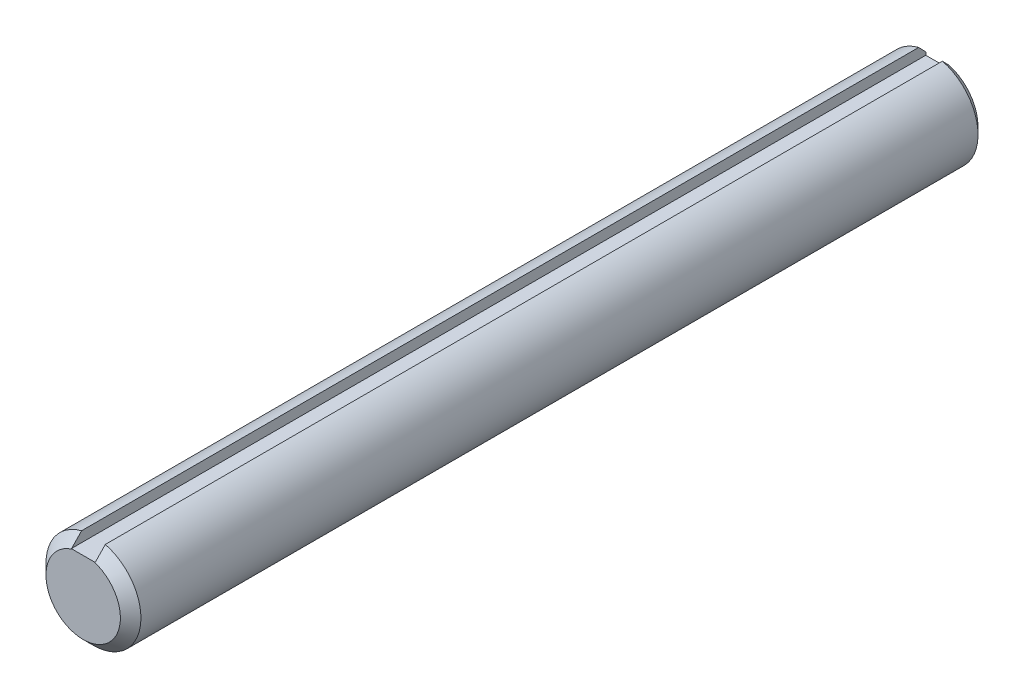
ISO-10303-21;
HEADER;
FILE_DESCRIPTION(('STEP AP214'),'2;1');
FILE_NAME('part.step','',(''),(''),'','','');
FILE_SCHEMA(('AUTOMOTIVE_DESIGN { 1 0 10303 214 1 1 1 1 }'));
ENDSEC;
DATA;
#1=APPLICATION_CONTEXT('core data for automotive mechanical design processes');
#2=APPLICATION_PROTOCOL_DEFINITION('international standard','automotive_design',2000,#1);
#3=PRODUCT_CONTEXT('',#1,'mechanical');
#4=PRODUCT('Part','Part','',(#3));
#5=PRODUCT_RELATED_PRODUCT_CATEGORY('part','',(#4));
#6=PRODUCT_DEFINITION_FORMATION('','',#4);
#7=PRODUCT_DEFINITION_CONTEXT('part definition',#1,'design');
#8=PRODUCT_DEFINITION('design','',#6,#7);
#9=PRODUCT_DEFINITION_SHAPE('','',#8);
#10=(LENGTH_UNIT() NAMED_UNIT(*) SI_UNIT(.MILLI.,.METRE.));
#11=(NAMED_UNIT(*) PLANE_ANGLE_UNIT() SI_UNIT($,.RADIAN.));
#12=(NAMED_UNIT(*) SI_UNIT($,.STERADIAN.) SOLID_ANGLE_UNIT());
#13=UNCERTAINTY_MEASURE_WITH_UNIT(LENGTH_MEASURE(1.E-05),#10,'distance_accuracy_value','');
#14=(GEOMETRIC_REPRESENTATION_CONTEXT(3) GLOBAL_UNCERTAINTY_ASSIGNED_CONTEXT((#13)) GLOBAL_UNIT_ASSIGNED_CONTEXT((#10,
#11,#12)) REPRESENTATION_CONTEXT('',''));
#15=CARTESIAN_POINT('',(0.,0.,0.));
#16=DIRECTION('',(0.,0.,1.));
#17=DIRECTION('',(1.,0.,0.));
#18=AXIS2_PLACEMENT_3D('',#15,#16,#17);
#19=CARTESIAN_POINT('',(0.,0.,76.2));
#20=DIRECTION('',(0.,0.,-1.));
#21=DIRECTION('',(-1.,0.,0.));
#22=AXIS2_PLACEMENT_3D('',#19,#20,#21);
#23=CYLINDRICAL_SURFACE('',#22,6.35);
#24=DIRECTION('',(0.,0.,-1.));
#25=VECTOR('',#24,1.);
#26=CARTESIAN_POINT('',(1.5875,6.14836106210427,76.2));
#27=LINE('',#26,#25);
#28=CARTESIAN_POINT('',(1.5875,6.14836106210427,-75.2474999999999));
#29=VERTEX_POINT('',#28);
#30=CARTESIAN_POINT('',(1.5875,6.14836106210427,36.726477474));
#31=VERTEX_POINT('',#30);
#32=EDGE_CURVE('E121',#29,#31,#27,.F.);
#33=ORIENTED_EDGE('',*,*,#32,.T.);
#34=CARTESIAN_POINT('',(0.,0.,36.726477474));
#35=DIRECTION('',(0.,0.,1.));
#36=DIRECTION('',(1.,0.,0.));
#37=AXIS2_PLACEMENT_3D('',#34,#35,#36);
#38=CIRCLE('',#37,6.35);
#39=CARTESIAN_POINT('',(-1.5875,6.14836106210427,36.726477474));
#40=VERTEX_POINT('',#39);
#41=EDGE_CURVE('E50',#31,#40,#38,.F.);
#42=ORIENTED_EDGE('',*,*,#41,.T.);
#43=DIRECTION('',(0.,0.,-1.));
#44=VECTOR('',#43,1.);
#45=CARTESIAN_POINT('',(-1.5875,6.14836106210427,76.2));
#46=LINE('',#45,#44);
#47=CARTESIAN_POINT('',(-1.5875,6.14836106210427,-75.2474999999999));
#48=VERTEX_POINT('',#47);
#49=EDGE_CURVE('E131',#40,#48,#46,.T.);
#50=ORIENTED_EDGE('',*,*,#49,.T.);
#51=CARTESIAN_POINT('',(0.,0.,-75.2474999999999));
#52=DIRECTION('',(0.,0.,1.));
#53=DIRECTION('',(1.,0.,0.));
#54=AXIS2_PLACEMENT_3D('',#51,#52,#53);
#55=CIRCLE('',#54,6.35);
#56=EDGE_CURVE('E169',#48,#29,#55,.T.);
#57=ORIENTED_EDGE('',*,*,#56,.T.);
#58=EDGE_LOOP('',(#33,#42,#50,#57));
#59=FACE_BOUND('',#58,.T.);
#60=ADVANCED_FACE('F35',(#59),#23,.T.);
#61=CARTESIAN_POINT('',(-1.5875,6.35,-76.2));
#62=DIRECTION('',(-1.,0.,0.));
#63=DIRECTION('',(0.,-1.,0.));
#64=AXIS2_PLACEMENT_3D('',#61,#62,#63);
#65=PLANE('',#64);
#66=ORIENTED_EDGE('',*,*,#49,.F.);
#67=CARTESIAN_POINT('',(-1.5875,6.14836106210428,36.726477474));
#68=CARTESIAN_POINT('',(-1.5875,6.03336789474387,36.837816321873));
#69=CARTESIAN_POINT('',(-1.5875,5.91827987354909,36.9490573642583));
#70=CARTESIAN_POINT('',(-1.5875,5.68787357366818,37.1712992426098));
#71=CARTESIAN_POINT('',(-1.5875,5.57255529644475,37.2823000800926));
#72=CARTESIAN_POINT('',(-1.5875,5.34164624267527,37.5040185916594));
#73=CARTESIAN_POINT('',(-1.5875,5.22605546557106,37.6147362651625));
#74=CARTESIAN_POINT('',(-1.5875,4.99454160696051,37.8358250479106));
#75=CARTESIAN_POINT('',(-1.5875,4.87861852334753,37.9461961549492));
#76=CARTESIAN_POINT('',(-1.5875,4.7625,38.0563616884828));
#77=B_SPLINE_CURVE_WITH_KNOTS('',3,(#67,#68,#69,#70,#71,#72,#73,#74,#75,#76),.UNSPECIFIED.,.F.,
.F.,(4,2,2,2,4),(0.,0.480185385737945,0.960367730767003,1.44055106023391,1.9207374405834),.UNSPECIFIED.);
#78=CARTESIAN_POINT('',(-1.5875,4.7625,38.0563616884827));
#79=VERTEX_POINT('',#78);
#80=EDGE_CURVE('E12',#40,#79,#77,.T.);
#81=ORIENTED_EDGE('',*,*,#80,.T.);
#82=DIRECTION('',(0.,0.,1.));
#83=VECTOR('',#82,1.);
#84=CARTESIAN_POINT('',(-1.5875,4.7625,-76.2));
#85=LINE('',#84,#83);
#86=CARTESIAN_POINT('',(-1.5875,4.7625,-76.2));
#87=VERTEX_POINT('',#86);
#88=EDGE_CURVE('E93',#87,#79,#85,.T.);
#89=ORIENTED_EDGE('',*,*,#88,.F.);
#90=DIRECTION('',(0.,-1.,0.));
#91=VECTOR('',#90,1.);
#92=CARTESIAN_POINT('',(-1.5875,6.35,-76.2));
#93=LINE('',#92,#91);
#94=CARTESIAN_POINT('',(-1.5875,5.15876438694372,-76.2));
#95=VERTEX_POINT('',#94);
#96=EDGE_CURVE('E98',#95,#87,#93,.T.);
#97=ORIENTED_EDGE('',*,*,#96,.F.);
#98=CARTESIAN_POINT('',(-1.5875,2.50467512422004,-78.6321073231548));
#99=CARTESIAN_POINT('',(-1.5875,2.6199574879908,-78.5346705663947));
#100=CARTESIAN_POINT('',(-1.5875,2.73434819416604,-78.4361940960173));
#101=CARTESIAN_POINT('',(-1.5875,2.96171067704997,-78.2376318023627));
#102=CARTESIAN_POINT('',(-1.5875,3.07468256144112,-78.1375461025497));
#103=CARTESIAN_POINT('',(-1.5875,3.29956921576393,-77.9362383617078));
#104=CARTESIAN_POINT('',(-1.5875,3.41148417069844,-77.8350165265981));
#105=CARTESIAN_POINT('',(-1.5875,3.63450717009294,-77.6316835974312));
#106=CARTESIAN_POINT('',(-1.5875,3.74561519672356,-77.5295724838341));
#107=CARTESIAN_POINT('',(-1.5875,4.0779404146334,-77.2222751639229));
#108=CARTESIAN_POINT('',(-1.5875,4.29821694512226,-77.0160724676453));
#109=CARTESIAN_POINT('',(-1.5875,4.73715914530377,-76.6019423042723));
#110=CARTESIAN_POINT('',(-1.5875,4.95582472940174,-76.3940147467598));
#111=CARTESIAN_POINT('',(-1.5875,5.3919758515553,-75.9770487299095));
#112=CARTESIAN_POINT('',(-1.5875,5.60946170363256,-75.7680105987989));
#113=CARTESIAN_POINT('',(-1.5875,6.04362892921901,-75.3491110156674));
#114=CARTESIAN_POINT('',(-1.5875,6.26031032050704,-75.1392495820551));
#115=CARTESIAN_POINT('',(-1.5875,6.69313054205313,-74.7188746527964));
#116=CARTESIAN_POINT('',(-1.5875,6.90926924461324,-74.5083610257473));
#117=CARTESIAN_POINT('',(-1.5875,7.34108970538697,-74.0868665375563));
#118=CARTESIAN_POINT('',(-1.5875,7.55677146466178,-73.8758856775018));
#119=CARTESIAN_POINT('',(-1.5875,7.77229162734195,-73.6647404933434));
#120=B_SPLINE_CURVE_WITH_KNOTS('',3,(#98,#99,#100,#101,#102,#103,#104,#105,#106,#107,#108,#109,
#110,#111,#112,#113,#114,#115,#116,#117,#118,#119),.UNSPECIFIED.,.F.,.F.,(4,2,2,2,2,2,2,2,2,2,
4),(0.,0.452810247519127,0.905585918444131,1.35828081011678,1.81098567399958,2.71616025534631,
3.6213825895487,4.52635081760593,5.43129892508637,6.33644306352773,7.24158509760043),.UNSPECIFIED.);
#121=EDGE_CURVE('E171',#95,#48,#120,.T.);
#122=ORIENTED_EDGE('',*,*,#121,.T.);
#123=EDGE_LOOP('',(#66,#81,#89,#97,#122));
#124=FACE_BOUND('',#123,.T.);
#125=ADVANCED_FACE('F95',(#124),#65,.F.);
#126=CARTESIAN_POINT('',(1.5875,6.35,-76.2));
#127=DIRECTION('',(1.,0.,0.));
#128=DIRECTION('',(0.,1.,0.));
#129=AXIS2_PLACEMENT_3D('',#126,#127,#128);
#130=PLANE('',#129);
#131=DIRECTION('',(0.,0.,1.));
#132=VECTOR('',#131,1.);
#133=CARTESIAN_POINT('',(1.5875,4.7625,-76.2));
#134=LINE('',#133,#132);
#135=CARTESIAN_POINT('',(1.5875,4.7625,-76.2));
#136=VERTEX_POINT('',#135);
#137=CARTESIAN_POINT('',(1.5875,4.7625,38.0563616884827));
#138=VERTEX_POINT('',#137);
#139=EDGE_CURVE('E103',#136,#138,#134,.T.);
#140=ORIENTED_EDGE('',*,*,#139,.T.);
#141=CARTESIAN_POINT('',(1.5875,4.7625,38.0563616884828));
#142=CARTESIAN_POINT('',(1.5875,4.87861852334753,37.9461961549492));
#143=CARTESIAN_POINT('',(1.5875,4.99454160696051,37.8358250479106));
#144=CARTESIAN_POINT('',(1.5875,5.22605546557106,37.6147362651625));
#145=CARTESIAN_POINT('',(1.5875,5.34164624267527,37.5040185916594));
#146=CARTESIAN_POINT('',(1.5875,5.57255529644475,37.2823000800926));
#147=CARTESIAN_POINT('',(1.5875,5.68787357366818,37.1712992426098));
#148=CARTESIAN_POINT('',(1.5875,5.91827987354909,36.9490573642583));
#149=CARTESIAN_POINT('',(1.5875,6.03336789474387,36.837816321873));
#150=CARTESIAN_POINT('',(1.5875,6.14836106210428,36.726477474));
#151=B_SPLINE_CURVE_WITH_KNOTS('',3,(#141,#142,#143,#144,#145,#146,#147,#148,#149,#150),
.UNSPECIFIED.,.F.,.F.,(4,2,2,2,4),(0.,0.480186380349486,0.960369709816393,1.44055205484545,
1.9207374405834),.UNSPECIFIED.);
#152=EDGE_CURVE('E64',#138,#31,#151,.T.);
#153=ORIENTED_EDGE('',*,*,#152,.T.);
#154=ORIENTED_EDGE('',*,*,#32,.F.);
#155=CARTESIAN_POINT('',(1.5875,7.77229162734195,-73.6647404933434));
#156=CARTESIAN_POINT('',(1.5875,7.55677146466178,-73.8758856775018));
#157=CARTESIAN_POINT('',(1.5875,7.34108970538697,-74.0868665375563));
#158=CARTESIAN_POINT('',(1.5875,6.90926924461324,-74.5083610257473));
#159=CARTESIAN_POINT('',(1.5875,6.69313054205313,-74.7188746527964));
#160=CARTESIAN_POINT('',(1.5875,6.26031032050704,-75.1392495820551));
#161=CARTESIAN_POINT('',(1.5875,6.04362892921901,-75.3491110156674));
#162=CARTESIAN_POINT('',(1.5875,5.60946170363256,-75.7680105987989));
#163=CARTESIAN_POINT('',(1.5875,5.3919758515553,-75.9770487299095));
#164=CARTESIAN_POINT('',(1.5875,4.95582472940174,-76.3940147467598));
#165=CARTESIAN_POINT('',(1.5875,4.73715914530377,-76.6019423042723));
#166=CARTESIAN_POINT('',(1.5875,4.29821694512226,-77.0160724676453));
#167=CARTESIAN_POINT('',(1.5875,4.0779404146334,-77.2222751639229));
#168=CARTESIAN_POINT('',(1.5875,3.74561519672356,-77.5295724838341));
#169=CARTESIAN_POINT('',(1.5875,3.63450717009294,-77.6316835974312));
#170=CARTESIAN_POINT('',(1.5875,3.41148417069844,-77.8350165265981));
#171=CARTESIAN_POINT('',(1.5875,3.29956921576393,-77.9362383617078));
#172=CARTESIAN_POINT('',(1.5875,3.07468256144112,-78.1375461025497));
#173=CARTESIAN_POINT('',(1.5875,2.96171067704997,-78.2376318023627));
#174=CARTESIAN_POINT('',(1.5875,2.73434819416604,-78.4361940960173));
#175=CARTESIAN_POINT('',(1.5875,2.6199574879908,-78.5346705663947));
#176=CARTESIAN_POINT('',(1.5875,2.50467512422004,-78.6321073231548));
#177=B_SPLINE_CURVE_WITH_KNOTS('',3,(#155,#156,#157,#158,#159,#160,#161,#162,#163,#164,#165,
#166,#167,#168,#169,#170,#171,#172,#173,#174,#175,#176),.UNSPECIFIED.,.F.,.F.,(4,2,2,2,2,2,2,2,
2,2,4),(0.,0.905142034072703,1.81028617251406,2.7152342799945,3.62020250805173,4.52542484225412,
5.43059942360086,5.88330428748366,6.3359991791563,6.7887748500813,7.24158509760043),.UNSPECIFIED.);
#178=CARTESIAN_POINT('',(1.5875,5.15876438694372,-76.2));
#179=VERTEX_POINT('',#178);
#180=EDGE_CURVE('E124',#29,#179,#177,.T.);
#181=ORIENTED_EDGE('',*,*,#180,.T.);
#182=DIRECTION('',(0.,1.,0.));
#183=VECTOR('',#182,1.);
#184=CARTESIAN_POINT('',(1.5875,6.35,-76.2));
#185=LINE('',#184,#183);
#186=EDGE_CURVE('E104',#136,#179,#185,.T.);
#187=ORIENTED_EDGE('',*,*,#186,.F.);
#188=EDGE_LOOP('',(#140,#153,#154,#181,#187));
#189=FACE_BOUND('',#188,.T.);
#190=ADVANCED_FACE('F136',(#189),#130,.F.);
#191=CARTESIAN_POINT('',(-1.5875,4.7625,-76.2));
#192=DIRECTION('',(0.,-1.,0.));
#193=DIRECTION('',(0.,0.,-1.));
#194=AXIS2_PLACEMENT_3D('',#191,#192,#193);
#195=PLANE('',#194);
#196=DIRECTION('',(-1.,0.,0.));
#197=VECTOR('',#196,1.);
#198=CARTESIAN_POINT('',(-1.5875,4.7625,38.1));
#199=LINE('',#198,#197);
#200=CARTESIAN_POINT('',(1.4435795091473,4.7625,38.1));
#201=VERTEX_POINT('',#200);
#202=CARTESIAN_POINT('',(-1.4435795091473,4.7625,38.1));
#203=VERTEX_POINT('',#202);
#204=EDGE_CURVE('E165',#201,#203,#199,.T.);
#205=ORIENTED_EDGE('',*,*,#204,.F.);
#206=CARTESIAN_POINT('',(1.4435795091473,4.7625,38.1));
#207=CARTESIAN_POINT('',(1.46765334194809,4.7625,38.0930141413426));
#208=CARTESIAN_POINT('',(1.49168363445582,4.7625,38.0858846854626));
#209=CARTESIAN_POINT('',(1.53965713137948,4.7625,38.0713385815337));
#210=CARTESIAN_POINT('',(1.56360033582264,4.7625,38.0639219335745));
#211=CARTESIAN_POINT('',(1.5875,4.7625,38.0563616884828));
#212=B_SPLINE_CURVE_WITH_KNOTS('',3,(#206,#207,#208,#209,#210,#211),.UNSPECIFIED.,.F.,.F.,(4,2,
4),(0.,0.0751967877795279,0.150393552029172),.UNSPECIFIED.);
#213=EDGE_CURVE('E150',#201,#138,#212,.T.);
#214=ORIENTED_EDGE('',*,*,#213,.T.);
#215=ORIENTED_EDGE('',*,*,#139,.F.);
#216=DIRECTION('',(1.,0.,0.));
#217=VECTOR('',#216,1.);
#218=CARTESIAN_POINT('',(-1.5875,4.7625,-76.2));
#219=LINE('',#218,#217);
#220=EDGE_CURVE('E107',#87,#136,#219,.T.);
#221=ORIENTED_EDGE('',*,*,#220,.F.);
#222=ORIENTED_EDGE('',*,*,#88,.T.);
#223=CARTESIAN_POINT('',(-1.5875,4.7625,38.0563616884828));
#224=CARTESIAN_POINT('',(-1.56360033582264,4.7625,38.0639219335745));
#225=CARTESIAN_POINT('',(-1.53965713137948,4.7625,38.0713385815337));
#226=CARTESIAN_POINT('',(-1.49168363445582,4.7625,38.0858846854626));
#227=CARTESIAN_POINT('',(-1.46765334194809,4.7625,38.0930141413426));
#228=CARTESIAN_POINT('',(-1.4435795091473,4.7625,38.1));
#229=B_SPLINE_CURVE_WITH_KNOTS('',3,(#223,#224,#225,#226,#227,#228),.UNSPECIFIED.,.F.,.F.,(4,2,
4),(0.,0.0751967642496436,0.150393552029171),.UNSPECIFIED.);
#230=EDGE_CURVE('E156',#79,#203,#229,.T.);
#231=ORIENTED_EDGE('',*,*,#230,.T.);
#232=EDGE_LOOP('',(#205,#214,#215,#221,#222,#231));
#233=FACE_BOUND('',#232,.T.);
#234=ADVANCED_FACE('F109',(#233),#195,.F.);
#235=CARTESIAN_POINT('',(0.,0.,-76.2));
#236=DIRECTION('',(0.,0.,1.));
#237=DIRECTION('',(1.,0.,0.));
#238=AXIS2_PLACEMENT_3D('',#235,#236,#237);
#239=PLANE('',#238);
#240=CARTESIAN_POINT('',(0.,0.,-76.2));
#241=DIRECTION('',(0.,0.,1.));
#242=DIRECTION('',(1.,0.,0.));
#243=AXIS2_PLACEMENT_3D('',#240,#241,#242);
#244=CIRCLE('',#243,5.39749999999989);
#245=EDGE_CURVE('E117',#179,#95,#244,.F.);
#246=ORIENTED_EDGE('',*,*,#245,.T.);
#247=ORIENTED_EDGE('',*,*,#96,.T.);
#248=ORIENTED_EDGE('',*,*,#220,.T.);
#249=ORIENTED_EDGE('',*,*,#186,.T.);
#250=EDGE_LOOP('',(#246,#247,#248,#249));
#251=FACE_BOUND('',#250,.T.);
#252=ADVANCED_FACE('F115',(#251),#239,.F.);
#253=CARTESIAN_POINT('',(0.,0.,-75.2474999999999));
#254=DIRECTION('',(0.,0.,1.));
#255=DIRECTION('',(1.,0.,0.));
#256=AXIS2_PLACEMENT_3D('',#253,#254,#255);
#257=CONICAL_SURFACE('',#256,6.35,0.785398163397451);
#258=ORIENTED_EDGE('',*,*,#121,.F.);
#259=ORIENTED_EDGE('',*,*,#245,.F.);
#260=ORIENTED_EDGE('',*,*,#180,.F.);
#261=ORIENTED_EDGE('',*,*,#56,.F.);
#262=EDGE_LOOP('',(#258,#259,#260,#261));
#263=FACE_BOUND('',#262,.T.);
#264=ADVANCED_FACE('F133',(#263),#257,.T.);
#265=CARTESIAN_POINT('',(0.,0.,38.1));
#266=DIRECTION('',(0.,0.,1.));
#267=DIRECTION('',(1.,0.,0.));
#268=AXIS2_PLACEMENT_3D('',#265,#266,#267);
#269=PLANE('',#268);
#270=ORIENTED_EDGE('',*,*,#204,.T.);
#271=CARTESIAN_POINT('',(0.,0.,38.1));
#272=DIRECTION('',(0.,0.,1.));
#273=DIRECTION('',(1.,0.,0.));
#274=AXIS2_PLACEMENT_3D('',#271,#272,#273);
#275=CIRCLE('',#274,4.97647747400005);
#276=EDGE_CURVE('E162',#203,#201,#275,.T.);
#277=ORIENTED_EDGE('',*,*,#276,.T.);
#278=EDGE_LOOP('',(#270,#277));
#279=FACE_BOUND('',#278,.T.);
#280=ADVANCED_FACE('F141',(#279),#269,.T.);
#281=CARTESIAN_POINT('',(0.,0.,38.1));
#282=DIRECTION('',(0.,0.,-1.));
#283=DIRECTION('',(-1.,0.,0.));
#284=AXIS2_PLACEMENT_3D('',#281,#282,#283);
#285=CONICAL_SURFACE('',#284,4.97647747400005,0.785398163397438);
#286=ORIENTED_EDGE('',*,*,#80,.F.);
#287=ORIENTED_EDGE('',*,*,#41,.F.);
#288=ORIENTED_EDGE('',*,*,#152,.F.);
#289=ORIENTED_EDGE('',*,*,#213,.F.);
#290=ORIENTED_EDGE('',*,*,#276,.F.);
#291=ORIENTED_EDGE('',*,*,#230,.F.);
#292=EDGE_LOOP('',(#286,#287,#288,#289,#290,#291));
#293=FACE_BOUND('',#292,.T.);
#294=ADVANCED_FACE('F38',(#293),#285,.T.);
#295=CLOSED_SHELL('',(#60,#125,#190,#234,#252,#264,#280,#294));
#296=MANIFOLD_SOLID_BREP('B2',#295);
#297=ADVANCED_BREP_SHAPE_REPRESENTATION('',(#18,#296),#14);
#298=SHAPE_DEFINITION_REPRESENTATION(#9,#297);
ENDSEC;
END-ISO-10303-21;
